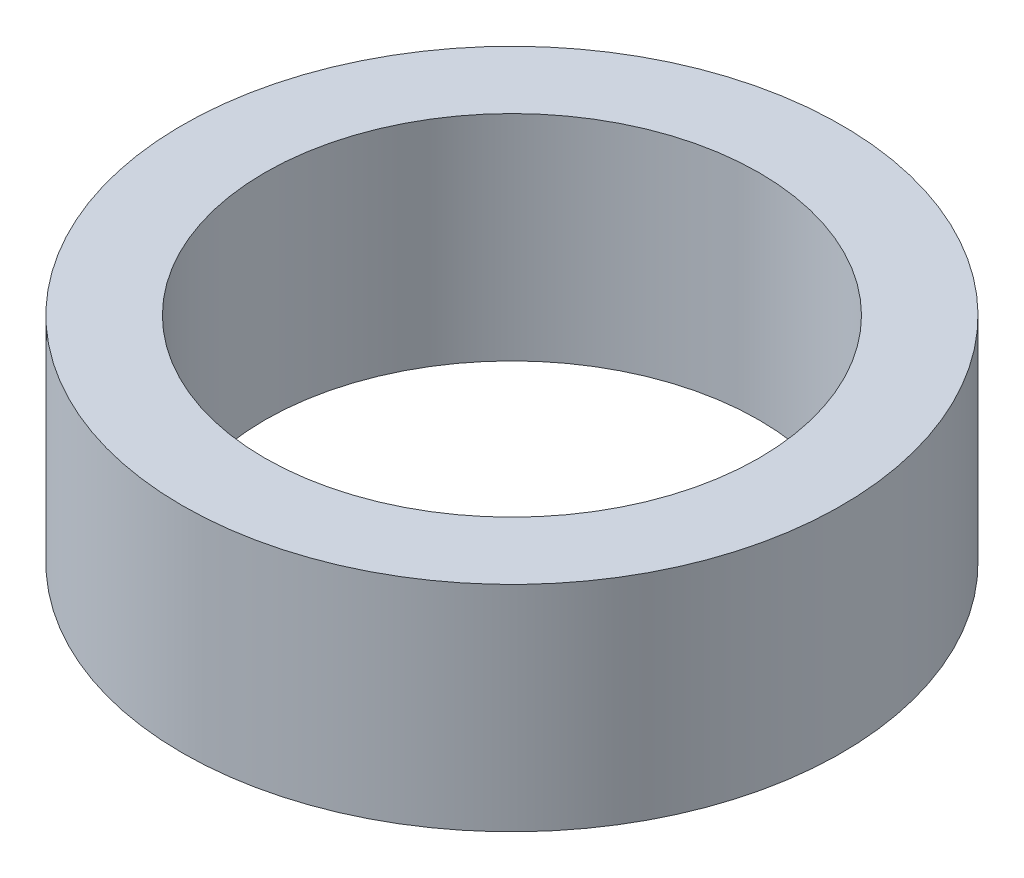
ISO-10303-21;
HEADER;
FILE_DESCRIPTION(('STEP AP214'),'2;1');
FILE_NAME('part.step','',(''),(''),'','','');
FILE_SCHEMA(('AUTOMOTIVE_DESIGN { 1 0 10303 214 1 1 1 1 }'));
ENDSEC;
DATA;
#1=APPLICATION_CONTEXT('core data for automotive mechanical design processes');
#2=APPLICATION_PROTOCOL_DEFINITION('international standard','automotive_design',2000,#1);
#3=PRODUCT_CONTEXT('',#1,'mechanical');
#4=PRODUCT('Part','Part','',(#3));
#5=PRODUCT_RELATED_PRODUCT_CATEGORY('part','',(#4));
#6=PRODUCT_DEFINITION_FORMATION('','',#4);
#7=PRODUCT_DEFINITION_CONTEXT('part definition',#1,'design');
#8=PRODUCT_DEFINITION('design','',#6,#7);
#9=PRODUCT_DEFINITION_SHAPE('','',#8);
#10=(LENGTH_UNIT() NAMED_UNIT(*) SI_UNIT(.MILLI.,.METRE.));
#11=(NAMED_UNIT(*) PLANE_ANGLE_UNIT() SI_UNIT($,.RADIAN.));
#12=(NAMED_UNIT(*) SI_UNIT($,.STERADIAN.) SOLID_ANGLE_UNIT());
#13=UNCERTAINTY_MEASURE_WITH_UNIT(LENGTH_MEASURE(1.E-05),#10,'distance_accuracy_value','');
#14=(GEOMETRIC_REPRESENTATION_CONTEXT(3) GLOBAL_UNCERTAINTY_ASSIGNED_CONTEXT((#13)) GLOBAL_UNIT_ASSIGNED_CONTEXT((#10,
#11,#12)) REPRESENTATION_CONTEXT('',''));
#15=CARTESIAN_POINT('',(0.,0.,0.));
#16=DIRECTION('',(0.,0.,1.));
#17=DIRECTION('',(1.,0.,0.));
#18=AXIS2_PLACEMENT_3D('',#15,#16,#17);
#19=CARTESIAN_POINT('',(0.,8.255,0.));
#20=DIRECTION('',(0.,1.,0.));
#21=DIRECTION('',(0.,0.,1.));
#22=AXIS2_PLACEMENT_3D('',#19,#20,#21);
#23=PLANE('',#22);
#24=CARTESIAN_POINT('',(0.,8.255,0.));
#25=DIRECTION('',(0.,1.,0.));
#26=DIRECTION('',(0.,0.,1.));
#27=AXIS2_PLACEMENT_3D('',#24,#25,#26);
#28=CIRCLE('',#27,12.7);
#29=CARTESIAN_POINT('',(0.,8.255,12.7));
#30=VERTEX_POINT('',#29);
#31=EDGE_CURVE('E10',#30,#30,#28,.T.);
#32=ORIENTED_EDGE('',*,*,#31,.T.);
#33=EDGE_LOOP('',(#32));
#34=FACE_BOUND('',#33,.T.);
#35=CARTESIAN_POINT('',(0.,8.255,0.));
#36=DIRECTION('',(0.,1.,0.));
#37=DIRECTION('',(0.,0.,1.));
#38=AXIS2_PLACEMENT_3D('',#35,#36,#37);
#39=CIRCLE('',#38,9.525);
#40=CARTESIAN_POINT('',(0.,8.255,9.525));
#41=VERTEX_POINT('',#40);
#42=EDGE_CURVE('E41',#41,#41,#39,.T.);
#43=ORIENTED_EDGE('',*,*,#42,.F.);
#44=EDGE_LOOP('',(#43));
#45=FACE_BOUND('',#44,.T.);
#46=ADVANCED_FACE('F30',(#34,#45),#23,.T.);
#47=CARTESIAN_POINT('',(0.,0.,0.));
#48=DIRECTION('',(0.,1.,0.));
#49=DIRECTION('',(0.,0.,1.));
#50=AXIS2_PLACEMENT_3D('',#47,#48,#49);
#51=PLANE('',#50);
#52=CARTESIAN_POINT('',(0.,0.,0.));
#53=DIRECTION('',(0.,1.,0.));
#54=DIRECTION('',(0.,0.,1.));
#55=AXIS2_PLACEMENT_3D('',#52,#53,#54);
#56=CIRCLE('',#55,12.7);
#57=CARTESIAN_POINT('',(0.,0.,12.7));
#58=VERTEX_POINT('',#57);
#59=EDGE_CURVE('E34',#58,#58,#56,.T.);
#60=ORIENTED_EDGE('',*,*,#59,.F.);
#61=EDGE_LOOP('',(#60));
#62=FACE_BOUND('',#61,.T.);
#63=CARTESIAN_POINT('',(0.,0.,0.));
#64=DIRECTION('',(0.,1.,0.));
#65=DIRECTION('',(0.,0.,1.));
#66=AXIS2_PLACEMENT_3D('',#63,#64,#65);
#67=CIRCLE('',#66,9.525);
#68=CARTESIAN_POINT('',(0.,0.,9.525));
#69=VERTEX_POINT('',#68);
#70=EDGE_CURVE('E43',#69,#69,#67,.T.);
#71=ORIENTED_EDGE('',*,*,#70,.T.);
#72=EDGE_LOOP('',(#71));
#73=FACE_BOUND('',#72,.T.);
#74=ADVANCED_FACE('F53',(#62,#73),#51,.F.);
#75=CARTESIAN_POINT('',(0.,8.255,0.));
#76=DIRECTION('',(0.,-1.,0.));
#77=DIRECTION('',(0.,0.,-1.));
#78=AXIS2_PLACEMENT_3D('',#75,#76,#77);
#79=CYLINDRICAL_SURFACE('',#78,12.7);
#80=ORIENTED_EDGE('',*,*,#31,.F.);
#81=EDGE_LOOP('',(#80));
#82=FACE_BOUND('',#81,.T.);
#83=ORIENTED_EDGE('',*,*,#59,.T.);
#84=EDGE_LOOP('',(#83));
#85=FACE_BOUND('',#84,.T.);
#86=ADVANCED_FACE('F32',(#82,#85),#79,.T.);
#87=CARTESIAN_POINT('',(0.,8.255,0.));
#88=DIRECTION('',(0.,-1.,0.));
#89=DIRECTION('',(0.,0.,-1.));
#90=AXIS2_PLACEMENT_3D('',#87,#88,#89);
#91=CYLINDRICAL_SURFACE('',#90,9.525);
#92=ORIENTED_EDGE('',*,*,#42,.T.);
#93=EDGE_LOOP('',(#92));
#94=FACE_BOUND('',#93,.T.);
#95=ORIENTED_EDGE('',*,*,#70,.F.);
#96=EDGE_LOOP('',(#95));
#97=FACE_BOUND('',#96,.T.);
#98=ADVANCED_FACE('F49',(#94,#97),#91,.F.);
#99=CLOSED_SHELL('',(#46,#74,#86,#98));
#100=MANIFOLD_SOLID_BREP('B2',#99);
#101=ADVANCED_BREP_SHAPE_REPRESENTATION('',(#18,#100),#14);
#102=SHAPE_DEFINITION_REPRESENTATION(#9,#101);
ENDSEC;
END-ISO-10303-21;
